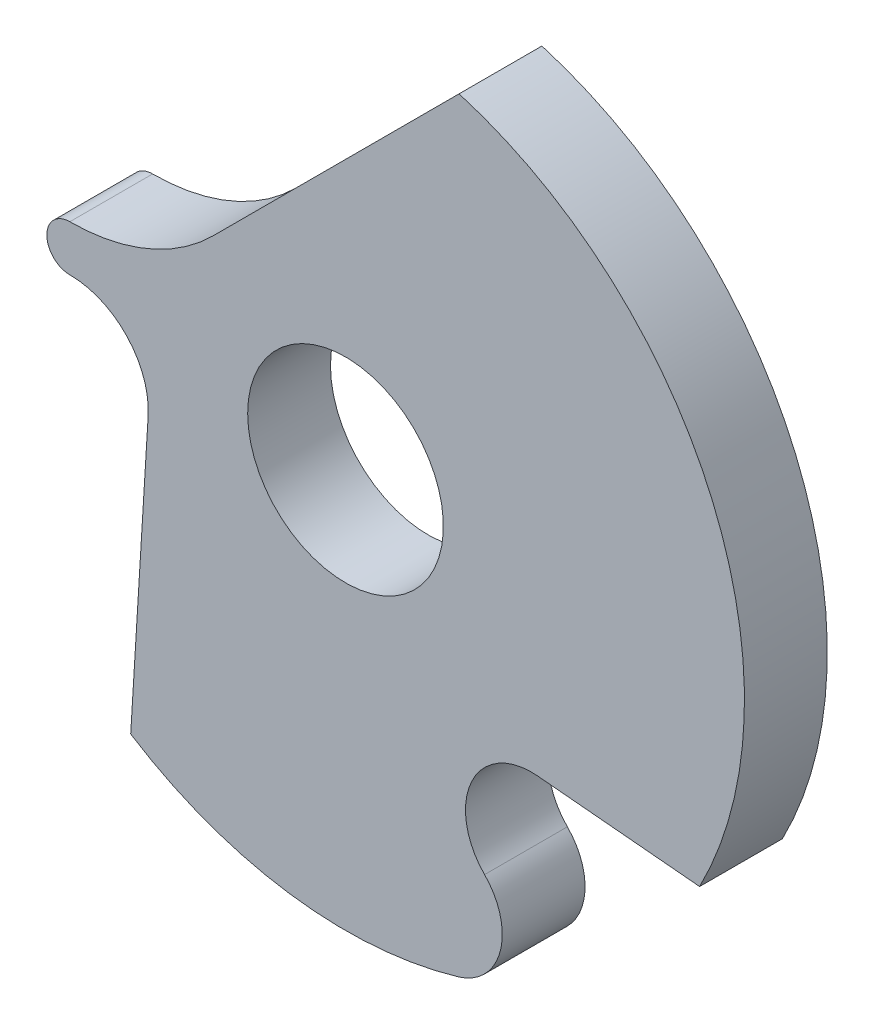
ISO-10303-21;
HEADER;
FILE_DESCRIPTION(('STEP AP214'),'2;1');
FILE_NAME('part.step','',(''),(''),'','','');
FILE_SCHEMA(('AUTOMOTIVE_DESIGN { 1 0 10303 214 1 1 1 1 }'));
ENDSEC;
DATA;
#1=APPLICATION_CONTEXT('core data for automotive mechanical design processes');
#2=APPLICATION_PROTOCOL_DEFINITION('international standard','automotive_design',2000,#1);
#3=PRODUCT_CONTEXT('',#1,'mechanical');
#4=PRODUCT('Part','Part','',(#3));
#5=PRODUCT_RELATED_PRODUCT_CATEGORY('part','',(#4));
#6=PRODUCT_DEFINITION_FORMATION('','',#4);
#7=PRODUCT_DEFINITION_CONTEXT('part definition',#1,'design');
#8=PRODUCT_DEFINITION('design','',#6,#7);
#9=PRODUCT_DEFINITION_SHAPE('','',#8);
#10=(LENGTH_UNIT() NAMED_UNIT(*) SI_UNIT(.MILLI.,.METRE.));
#11=(NAMED_UNIT(*) PLANE_ANGLE_UNIT() SI_UNIT($,.RADIAN.));
#12=(NAMED_UNIT(*) SI_UNIT($,.STERADIAN.) SOLID_ANGLE_UNIT());
#13=UNCERTAINTY_MEASURE_WITH_UNIT(LENGTH_MEASURE(1.E-05),#10,'distance_accuracy_value','');
#14=(GEOMETRIC_REPRESENTATION_CONTEXT(3) GLOBAL_UNCERTAINTY_ASSIGNED_CONTEXT((#13)) GLOBAL_UNIT_ASSIGNED_CONTEXT((#10,
#11,#12)) REPRESENTATION_CONTEXT('',''));
#15=CARTESIAN_POINT('',(0.,0.,0.));
#16=DIRECTION('',(0.,0.,1.));
#17=DIRECTION('',(1.,0.,0.));
#18=AXIS2_PLACEMENT_3D('',#15,#16,#17);
#19=CARTESIAN_POINT('',(0.,0.,0.));
#20=DIRECTION('',(0.,0.,1.));
#21=DIRECTION('',(1.,0.,0.));
#22=AXIS2_PLACEMENT_3D('',#19,#20,#21);
#23=CYLINDRICAL_SURFACE('',#22,2.64999999999999);
#24=CARTESIAN_POINT('',(0.,0.,0.55));
#25=DIRECTION('',(0.,0.,1.));
#26=DIRECTION('',(1.,0.,0.));
#27=AXIS2_PLACEMENT_3D('',#24,#25,#26);
#28=CIRCLE('',#27,2.64999999999999);
#29=CARTESIAN_POINT('',(-1.4269503012527,-2.23300533760106,0.55));
#30=VERTEX_POINT('',#29);
#31=CARTESIAN_POINT('',(0.749973231789739,-2.54166090413313,0.55));
#32=VERTEX_POINT('',#31);
#33=EDGE_CURVE('E143',#30,#32,#28,.T.);
#34=ORIENTED_EDGE('',*,*,#33,.F.);
#35=DIRECTION('',(0.,0.,1.));
#36=VECTOR('',#35,1.);
#37=CARTESIAN_POINT('',(-1.4269503012527,-2.23300533760106,0.));
#38=LINE('',#37,#36);
#39=CARTESIAN_POINT('',(-1.4269503012527,-2.23300533760106,0.));
#40=VERTEX_POINT('',#39);
#41=EDGE_CURVE('E11',#40,#30,#38,.T.);
#42=ORIENTED_EDGE('',*,*,#41,.F.);
#43=CARTESIAN_POINT('',(0.,0.,0.));
#44=DIRECTION('',(0.,0.,1.));
#45=DIRECTION('',(1.,0.,0.));
#46=AXIS2_PLACEMENT_3D('',#43,#44,#45);
#47=CIRCLE('',#46,2.64999999999999);
#48=CARTESIAN_POINT('',(0.749973231789739,-2.54166090413313,0.));
#49=VERTEX_POINT('',#48);
#50=EDGE_CURVE('E170',#40,#49,#47,.T.);
#51=ORIENTED_EDGE('',*,*,#50,.T.);
#52=DIRECTION('',(0.,0.,1.));
#53=VECTOR('',#52,1.);
#54=CARTESIAN_POINT('',(0.749973231789739,-2.54166090413313,0.));
#55=LINE('',#54,#53);
#56=EDGE_CURVE('E37',#49,#32,#55,.T.);
#57=ORIENTED_EDGE('',*,*,#56,.T.);
#58=EDGE_LOOP('',(#34,#42,#51,#57));
#59=FACE_BOUND('',#58,.T.);
#60=ADVANCED_FACE('F34',(#59),#23,.T.);
#61=CARTESIAN_POINT('',(-1.31106100836404,-0.347021148405907,0.));
#62=DIRECTION('',(-0.998117422788922,0.0613319682156066,0.));
#63=DIRECTION('',(-0.0613319682156066,-0.998117422788922,0.));
#64=AXIS2_PLACEMENT_3D('',#61,#62,#63);
#65=PLANE('',#64);
#66=DIRECTION('',(-0.0613319682156066,-0.998117422788922,0.));
#67=VECTOR('',#66,1.);
#68=CARTESIAN_POINT('',(-1.31106100836404,-0.347021148405907,0.55));
#69=LINE('',#68,#67);
#70=CARTESIAN_POINT('',(-1.31106100836399,-0.34702114840591,0.55));
#71=VERTEX_POINT('',#70);
#72=EDGE_CURVE('E168',#71,#30,#69,.T.);
#73=ORIENTED_EDGE('',*,*,#72,.F.);
#74=DIRECTION('',(0.,0.,1.));
#75=VECTOR('',#74,1.);
#76=CARTESIAN_POINT('',(-1.31106100836399,-0.34702114840591,0.));
#77=LINE('',#76,#75);
#78=CARTESIAN_POINT('',(-1.31106100836399,-0.34702114840591,0.));
#79=VERTEX_POINT('',#78);
#80=EDGE_CURVE('E43',#79,#71,#77,.T.);
#81=ORIENTED_EDGE('',*,*,#80,.F.);
#82=DIRECTION('',(-0.0613319682156066,-0.998117422788922,0.));
#83=VECTOR('',#82,1.);
#84=CARTESIAN_POINT('',(-1.31106100836404,-0.347021148405907,0.));
#85=LINE('',#84,#83);
#86=EDGE_CURVE('E133',#79,#40,#85,.T.);
#87=ORIENTED_EDGE('',*,*,#86,.T.);
#88=ORIENTED_EDGE('',*,*,#41,.T.);
#89=EDGE_LOOP('',(#73,#81,#87,#88));
#90=FACE_BOUND('',#89,.T.);
#91=ADVANCED_FACE('F186',(#90),#65,.T.);
#92=CARTESIAN_POINT('',(-1.83128305068014,-0.31505472738578,0.));
#93=DIRECTION('',(0.,0.,1.));
#94=DIRECTION('',(1.,0.,0.));
#95=AXIS2_PLACEMENT_3D('',#92,#93,#94);
#96=CYLINDRICAL_SURFACE('',#95,0.521203247672563);
#97=CARTESIAN_POINT('',(-1.83128305068014,-0.31505472738578,0.55));
#98=DIRECTION('',(0.,0.,-1.));
#99=DIRECTION('',(-1.,0.,0.));
#100=AXIS2_PLACEMENT_3D('',#97,#98,#99);
#101=CIRCLE('',#100,0.521203247672563);
#102=CARTESIAN_POINT('',(-1.83128305068014,0.206148520286836,0.55));
#103=VERTEX_POINT('',#102);
#104=EDGE_CURVE('E120',#103,#71,#101,.T.);
#105=ORIENTED_EDGE('',*,*,#104,.F.);
#106=DIRECTION('',(0.,0.,1.));
#107=VECTOR('',#106,1.);
#108=CARTESIAN_POINT('',(-1.83128305068014,0.206148520286836,0.));
#109=LINE('',#108,#107);
#110=CARTESIAN_POINT('',(-1.83128305068014,0.206148520286836,0.));
#111=VERTEX_POINT('',#110);
#112=EDGE_CURVE('E115',#111,#103,#109,.T.);
#113=ORIENTED_EDGE('',*,*,#112,.F.);
#114=CARTESIAN_POINT('',(-1.83128305068014,-0.31505472738578,0.));
#115=DIRECTION('',(0.,0.,-1.));
#116=DIRECTION('',(-1.,0.,0.));
#117=AXIS2_PLACEMENT_3D('',#114,#115,#116);
#118=CIRCLE('',#117,0.521203247672563);
#119=EDGE_CURVE('E118',#111,#79,#118,.T.);
#120=ORIENTED_EDGE('',*,*,#119,.T.);
#121=ORIENTED_EDGE('',*,*,#80,.T.);
#122=EDGE_LOOP('',(#105,#113,#120,#121));
#123=FACE_BOUND('',#122,.T.);
#124=ADVANCED_FACE('F117',(#123),#96,.F.);
#125=CARTESIAN_POINT('',(-1.83128305068014,0.358848893873427,0.));
#126=DIRECTION('',(0.,0.,1.));
#127=DIRECTION('',(1.,0.,0.));
#128=AXIS2_PLACEMENT_3D('',#125,#126,#127);
#129=CYLINDRICAL_SURFACE('',#128,0.152700373586591);
#130=CARTESIAN_POINT('',(-1.83128305068014,0.358848893873427,0.55));
#131=DIRECTION('',(0.,0.,1.));
#132=DIRECTION('',(1.,0.,0.));
#133=AXIS2_PLACEMENT_3D('',#130,#131,#132);
#134=CIRCLE('',#133,0.152700373586591);
#135=CARTESIAN_POINT('',(-1.83128305068014,0.511549267460019,0.55));
#136=VERTEX_POINT('',#135);
#137=EDGE_CURVE('E165',#136,#103,#134,.T.);
#138=ORIENTED_EDGE('',*,*,#137,.F.);
#139=DIRECTION('',(0.,0.,1.));
#140=VECTOR('',#139,1.);
#141=CARTESIAN_POINT('',(-1.83128305068014,0.511549267460019,0.));
#142=LINE('',#141,#140);
#143=CARTESIAN_POINT('',(-1.83128305068014,0.511549267460019,0.));
#144=VERTEX_POINT('',#143);
#145=EDGE_CURVE('E125',#144,#136,#142,.T.);
#146=ORIENTED_EDGE('',*,*,#145,.F.);
#147=CARTESIAN_POINT('',(-1.83128305068014,0.358848893873427,0.));
#148=DIRECTION('',(0.,0.,1.));
#149=DIRECTION('',(1.,0.,0.));
#150=AXIS2_PLACEMENT_3D('',#147,#148,#149);
#151=CIRCLE('',#150,0.152700373586591);
#152=EDGE_CURVE('E131',#144,#111,#151,.T.);
#153=ORIENTED_EDGE('',*,*,#152,.T.);
#154=ORIENTED_EDGE('',*,*,#112,.T.);
#155=EDGE_LOOP('',(#138,#146,#153,#154));
#156=FACE_BOUND('',#155,.T.);
#157=ADVANCED_FACE('F135',(#156),#129,.T.);
#158=CARTESIAN_POINT('',(-1.83128305068014,1.85590672525355,0.));
#159=DIRECTION('',(0.,0.,1.));
#160=DIRECTION('',(1.,0.,0.));
#161=AXIS2_PLACEMENT_3D('',#158,#159,#160);
#162=CYLINDRICAL_SURFACE('',#161,1.34435745779353);
#163=CARTESIAN_POINT('',(-1.83128305068014,1.85590672525355,0.55));
#164=DIRECTION('',(0.,0.,-1.));
#165=DIRECTION('',(-1.,0.,0.));
#166=AXIS2_PLACEMENT_3D('',#163,#164,#165);
#167=CIRCLE('',#166,1.34435745779353);
#168=CARTESIAN_POINT('',(-0.880678775935631,0.905302450509036,0.55));
#169=VERTEX_POINT('',#168);
#170=EDGE_CURVE('E162',#169,#136,#167,.T.);
#171=ORIENTED_EDGE('',*,*,#170,.F.);
#172=DIRECTION('',(0.,0.,1.));
#173=VECTOR('',#172,1.);
#174=CARTESIAN_POINT('',(-0.880678775935631,0.905302450509036,0.));
#175=LINE('',#174,#173);
#176=CARTESIAN_POINT('',(-0.880678775935631,0.905302450509036,0.));
#177=VERTEX_POINT('',#176);
#178=EDGE_CURVE('E174',#177,#169,#175,.T.);
#179=ORIENTED_EDGE('',*,*,#178,.F.);
#180=CARTESIAN_POINT('',(-1.83128305068014,1.85590672525355,0.));
#181=DIRECTION('',(0.,0.,-1.));
#182=DIRECTION('',(-1.,0.,0.));
#183=AXIS2_PLACEMENT_3D('',#180,#181,#182);
#184=CIRCLE('',#183,1.34435745779353);
#185=EDGE_CURVE('E136',#177,#144,#184,.T.);
#186=ORIENTED_EDGE('',*,*,#185,.T.);
#187=ORIENTED_EDGE('',*,*,#145,.T.);
#188=EDGE_LOOP('',(#171,#179,#186,#187));
#189=FACE_BOUND('',#188,.T.);
#190=ADVANCED_FACE('F199',(#189),#162,.F.);
#191=CARTESIAN_POINT('',(0.754376305438115,2.54035753188278,0.));
#192=DIRECTION('',(-0.707106781186548,0.707106781186548,0.));
#193=DIRECTION('',(-0.707106781186548,-0.707106781186548,0.));
#194=AXIS2_PLACEMENT_3D('',#191,#192,#193);
#195=PLANE('',#194);
#196=DIRECTION('',(-0.707106781186548,-0.707106781186548,0.));
#197=VECTOR('',#196,1.);
#198=CARTESIAN_POINT('',(0.754376305438115,2.54035753188278,0.55));
#199=LINE('',#198,#197);
#200=CARTESIAN_POINT('',(0.754376305438114,2.54035753188278,0.55));
#201=VERTEX_POINT('',#200);
#202=EDGE_CURVE('E159',#201,#169,#199,.T.);
#203=ORIENTED_EDGE('',*,*,#202,.F.);
#204=DIRECTION('',(0.,0.,1.));
#205=VECTOR('',#204,1.);
#206=CARTESIAN_POINT('',(0.754376305438114,2.54035753188278,0.));
#207=LINE('',#206,#205);
#208=CARTESIAN_POINT('',(0.754376305438114,2.54035753188278,0.));
#209=VERTEX_POINT('',#208);
#210=EDGE_CURVE('E176',#209,#201,#207,.T.);
#211=ORIENTED_EDGE('',*,*,#210,.F.);
#212=DIRECTION('',(-0.707106781186548,-0.707106781186548,0.));
#213=VECTOR('',#212,1.);
#214=CARTESIAN_POINT('',(0.754376305438115,2.54035753188278,0.));
#215=LINE('',#214,#213);
#216=EDGE_CURVE('E138',#209,#177,#215,.T.);
#217=ORIENTED_EDGE('',*,*,#216,.T.);
#218=ORIENTED_EDGE('',*,*,#178,.T.);
#219=EDGE_LOOP('',(#203,#211,#217,#218));
#220=FACE_BOUND('',#219,.T.);
#221=ADVANCED_FACE('F202',(#220),#195,.T.);
#222=CARTESIAN_POINT('',(0.,0.,0.));
#223=DIRECTION('',(0.,0.,1.));
#224=DIRECTION('',(1.,0.,0.));
#225=AXIS2_PLACEMENT_3D('',#222,#223,#224);
#226=CYLINDRICAL_SURFACE('',#225,2.65000000000001);
#227=CARTESIAN_POINT('',(0.,0.,0.55));
#228=DIRECTION('',(0.,0.,1.));
#229=DIRECTION('',(1.,0.,0.));
#230=AXIS2_PLACEMENT_3D('',#227,#228,#229);
#231=CIRCLE('',#230,2.65000000000001);
#232=CARTESIAN_POINT('',(2.3519112143313,-1.22107069406432,0.55));
#233=VERTEX_POINT('',#232);
#234=EDGE_CURVE('E156',#233,#201,#231,.T.);
#235=ORIENTED_EDGE('',*,*,#234,.F.);
#236=DIRECTION('',(0.,0.,1.));
#237=VECTOR('',#236,1.);
#238=CARTESIAN_POINT('',(2.3519112143313,-1.22107069406432,0.));
#239=LINE('',#238,#237);
#240=CARTESIAN_POINT('',(2.3519112143313,-1.22107069406432,0.));
#241=VERTEX_POINT('',#240);
#242=EDGE_CURVE('E178',#241,#233,#239,.T.);
#243=ORIENTED_EDGE('',*,*,#242,.F.);
#244=CARTESIAN_POINT('',(0.,0.,0.));
#245=DIRECTION('',(0.,0.,1.));
#246=DIRECTION('',(1.,0.,0.));
#247=AXIS2_PLACEMENT_3D('',#244,#245,#246);
#248=CIRCLE('',#247,2.65000000000001);
#249=EDGE_CURVE('E251',#241,#209,#248,.T.);
#250=ORIENTED_EDGE('',*,*,#249,.T.);
#251=ORIENTED_EDGE('',*,*,#210,.T.);
#252=EDGE_LOOP('',(#235,#243,#250,#251));
#253=FACE_BOUND('',#252,.T.);
#254=ADVANCED_FACE('F206',(#253),#226,.T.);
#255=CARTESIAN_POINT('',(1.27423308759777,-1.12271833749915,0.));
#256=DIRECTION('',(-0.0908854954652522,-0.995861349141554,0.));
#257=DIRECTION('',(0.995861349141554,-0.0908854954652522,0.));
#258=AXIS2_PLACEMENT_3D('',#255,#256,#257);
#259=PLANE('',#258);
#260=DIRECTION('',(0.995861349141554,-0.0908854954652522,0.));
#261=VECTOR('',#260,1.);
#262=CARTESIAN_POINT('',(1.27423308759777,-1.12271833749915,0.55));
#263=LINE('',#262,#261);
#264=CARTESIAN_POINT('',(1.27423308759777,-1.12271833749915,0.55));
#265=VERTEX_POINT('',#264);
#266=EDGE_CURVE('E153',#265,#233,#263,.T.);
#267=ORIENTED_EDGE('',*,*,#266,.F.);
#268=DIRECTION('',(0.,0.,1.));
#269=VECTOR('',#268,1.);
#270=CARTESIAN_POINT('',(1.27423308759777,-1.12271833749915,0.));
#271=LINE('',#270,#269);
#272=CARTESIAN_POINT('',(1.27423308759777,-1.12271833749915,0.));
#273=VERTEX_POINT('',#272);
#274=EDGE_CURVE('E180',#273,#265,#271,.T.);
#275=ORIENTED_EDGE('',*,*,#274,.F.);
#276=DIRECTION('',(0.995861349141554,-0.0908854954652522,0.));
#277=VECTOR('',#276,1.);
#278=CARTESIAN_POINT('',(1.27423308759777,-1.12271833749915,0.));
#279=LINE('',#278,#277);
#280=EDGE_CURVE('E248',#273,#241,#279,.T.);
#281=ORIENTED_EDGE('',*,*,#280,.T.);
#282=ORIENTED_EDGE('',*,*,#242,.T.);
#283=EDGE_LOOP('',(#267,#275,#281,#282));
#284=FACE_BOUND('',#283,.T.);
#285=ADVANCED_FACE('F210',(#284),#259,.T.);
#286=CARTESIAN_POINT('',(1.23446099942937,-1.55851378735404,0.));
#287=DIRECTION('',(0.,0.,1.));
#288=DIRECTION('',(1.,0.,0.));
#289=AXIS2_PLACEMENT_3D('',#286,#287,#288);
#290=CYLINDRICAL_SURFACE('',#289,0.437606550581113);
#291=CARTESIAN_POINT('',(1.23446099942937,-1.55851378735404,0.55));
#292=DIRECTION('',(0.,0.,-1.));
#293=DIRECTION('',(-1.,0.,0.));
#294=AXIS2_PLACEMENT_3D('',#291,#292,#293);
#295=CIRCLE('',#294,0.437606550581113);
#296=CARTESIAN_POINT('',(0.923549504981388,-1.86646432840182,0.55));
#297=VERTEX_POINT('',#296);
#298=EDGE_CURVE('E150',#297,#265,#295,.T.);
#299=ORIENTED_EDGE('',*,*,#298,.F.);
#300=DIRECTION('',(0.,0.,1.));
#301=VECTOR('',#300,1.);
#302=CARTESIAN_POINT('',(0.923549504981388,-1.86646432840182,0.));
#303=LINE('',#302,#301);
#304=CARTESIAN_POINT('',(0.923549504981388,-1.86646432840182,0.));
#305=VERTEX_POINT('',#304);
#306=EDGE_CURVE('E181',#305,#297,#303,.T.);
#307=ORIENTED_EDGE('',*,*,#306,.F.);
#308=CARTESIAN_POINT('',(1.23446099942937,-1.55851378735404,0.));
#309=DIRECTION('',(0.,0.,-1.));
#310=DIRECTION('',(-1.,0.,0.));
#311=AXIS2_PLACEMENT_3D('',#308,#309,#310);
#312=CIRCLE('',#311,0.437606550581113);
#313=EDGE_CURVE('E245',#305,#273,#312,.T.);
#314=ORIENTED_EDGE('',*,*,#313,.T.);
#315=ORIENTED_EDGE('',*,*,#274,.T.);
#316=EDGE_LOOP('',(#299,#307,#314,#315));
#317=FACE_BOUND('',#316,.T.);
#318=ADVANCED_FACE('F214',(#317),#290,.F.);
#319=CARTESIAN_POINT('',(0.635056963516956,-2.15220942248385,0.));
#320=DIRECTION('',(0.,0.,1.));
#321=DIRECTION('',(1.,0.,0.));
#322=AXIS2_PLACEMENT_3D('',#319,#320,#321);
#323=CYLINDRICAL_SURFACE('',#322,0.406051973609975);
#324=CARTESIAN_POINT('',(0.635056963516956,-2.15220942248385,0.55));
#325=DIRECTION('',(0.,0.,1.));
#326=DIRECTION('',(1.,0.,0.));
#327=AXIS2_PLACEMENT_3D('',#324,#325,#326);
#328=CIRCLE('',#327,0.406051973609975);
#329=EDGE_CURVE('E146',#32,#297,#328,.T.);
#330=ORIENTED_EDGE('',*,*,#329,.F.);
#331=ORIENTED_EDGE('',*,*,#56,.F.);
#332=CARTESIAN_POINT('',(0.635056963516956,-2.15220942248385,0.));
#333=DIRECTION('',(0.,0.,1.));
#334=DIRECTION('',(1.,0.,0.));
#335=AXIS2_PLACEMENT_3D('',#332,#333,#334);
#336=CIRCLE('',#335,0.406051973609975);
#337=EDGE_CURVE('E243',#49,#305,#336,.T.);
#338=ORIENTED_EDGE('',*,*,#337,.T.);
#339=ORIENTED_EDGE('',*,*,#306,.T.);
#340=EDGE_LOOP('',(#330,#331,#338,#339));
#341=FACE_BOUND('',#340,.T.);
#342=ADVANCED_FACE('F183',(#341),#323,.T.);
#343=CARTESIAN_POINT('',(0.,0.,0.));
#344=DIRECTION('',(0.,0.,1.));
#345=DIRECTION('',(1.,0.,0.));
#346=AXIS2_PLACEMENT_3D('',#343,#344,#345);
#347=PLANE('',#346);
#348=CARTESIAN_POINT('',(0.,0.,0.));
#349=DIRECTION('',(0.,0.,1.));
#350=DIRECTION('',(-1.,0.,0.));
#351=AXIS2_PLACEMENT_3D('',#348,#349,#350);
#352=CIRCLE('',#351,0.649999999999986);
#353=CARTESIAN_POINT('',(-0.649999999999986,0.,0.));
#354=VERTEX_POINT('',#353);
#355=EDGE_CURVE('E147',#354,#354,#352,.T.);
#356=ORIENTED_EDGE('',*,*,#355,.T.);
#357=EDGE_LOOP('',(#356));
#358=FACE_BOUND('',#357,.T.);
#359=ORIENTED_EDGE('',*,*,#50,.F.);
#360=ORIENTED_EDGE('',*,*,#86,.F.);
#361=ORIENTED_EDGE('',*,*,#119,.F.);
#362=ORIENTED_EDGE('',*,*,#152,.F.);
#363=ORIENTED_EDGE('',*,*,#185,.F.);
#364=ORIENTED_EDGE('',*,*,#216,.F.);
#365=ORIENTED_EDGE('',*,*,#249,.F.);
#366=ORIENTED_EDGE('',*,*,#280,.F.);
#367=ORIENTED_EDGE('',*,*,#313,.F.);
#368=ORIENTED_EDGE('',*,*,#337,.F.);
#369=EDGE_LOOP('',(#359,#360,#361,#362,#363,#364,#365,#366,#367,#368));
#370=FACE_BOUND('',#369,.T.);
#371=ADVANCED_FACE('F129',(#358,#370),#347,.F.);
#372=CARTESIAN_POINT('',(0.,0.,0.55));
#373=DIRECTION('',(0.,0.,1.));
#374=DIRECTION('',(1.,0.,0.));
#375=AXIS2_PLACEMENT_3D('',#372,#373,#374);
#376=PLANE('',#375);
#377=CARTESIAN_POINT('',(0.,0.,0.55));
#378=DIRECTION('',(0.,0.,1.));
#379=DIRECTION('',(-1.,0.,0.));
#380=AXIS2_PLACEMENT_3D('',#377,#378,#379);
#381=CIRCLE('',#380,0.649999999999986);
#382=CARTESIAN_POINT('',(-0.649999999999986,0.,0.55));
#383=VERTEX_POINT('',#382);
#384=EDGE_CURVE('E238',#383,#383,#381,.T.);
#385=ORIENTED_EDGE('',*,*,#384,.F.);
#386=EDGE_LOOP('',(#385));
#387=FACE_BOUND('',#386,.T.);
#388=ORIENTED_EDGE('',*,*,#33,.T.);
#389=ORIENTED_EDGE('',*,*,#329,.T.);
#390=ORIENTED_EDGE('',*,*,#298,.T.);
#391=ORIENTED_EDGE('',*,*,#266,.T.);
#392=ORIENTED_EDGE('',*,*,#234,.T.);
#393=ORIENTED_EDGE('',*,*,#202,.T.);
#394=ORIENTED_EDGE('',*,*,#170,.T.);
#395=ORIENTED_EDGE('',*,*,#137,.T.);
#396=ORIENTED_EDGE('',*,*,#104,.T.);
#397=ORIENTED_EDGE('',*,*,#72,.T.);
#398=EDGE_LOOP('',(#388,#389,#390,#391,#392,#393,#394,#395,#396,#397));
#399=FACE_BOUND('',#398,.T.);
#400=ADVANCED_FACE('F185',(#387,#399),#376,.T.);
#401=CARTESIAN_POINT('',(0.,0.,0.));
#402=DIRECTION('',(0.,0.,1.));
#403=DIRECTION('',(1.,0.,0.));
#404=AXIS2_PLACEMENT_3D('',#401,#402,#403);
#405=CYLINDRICAL_SURFACE('',#404,0.649999999999986);
#406=ORIENTED_EDGE('',*,*,#355,.F.);
#407=EDGE_LOOP('',(#406));
#408=FACE_BOUND('',#407,.T.);
#409=ORIENTED_EDGE('',*,*,#384,.T.);
#410=EDGE_LOOP('',(#409));
#411=FACE_BOUND('',#410,.T.);
#412=ADVANCED_FACE('F226',(#408,#411),#405,.F.);
#413=CLOSED_SHELL('',(#60,#91,#124,#157,#190,#221,#254,#285,#318,#342,#371,#400,#412));
#414=MANIFOLD_SOLID_BREP('B2',#413);
#415=ADVANCED_BREP_SHAPE_REPRESENTATION('',(#18,#414),#14);
#416=SHAPE_DEFINITION_REPRESENTATION(#9,#415);
ENDSEC;
END-ISO-10303-21;
